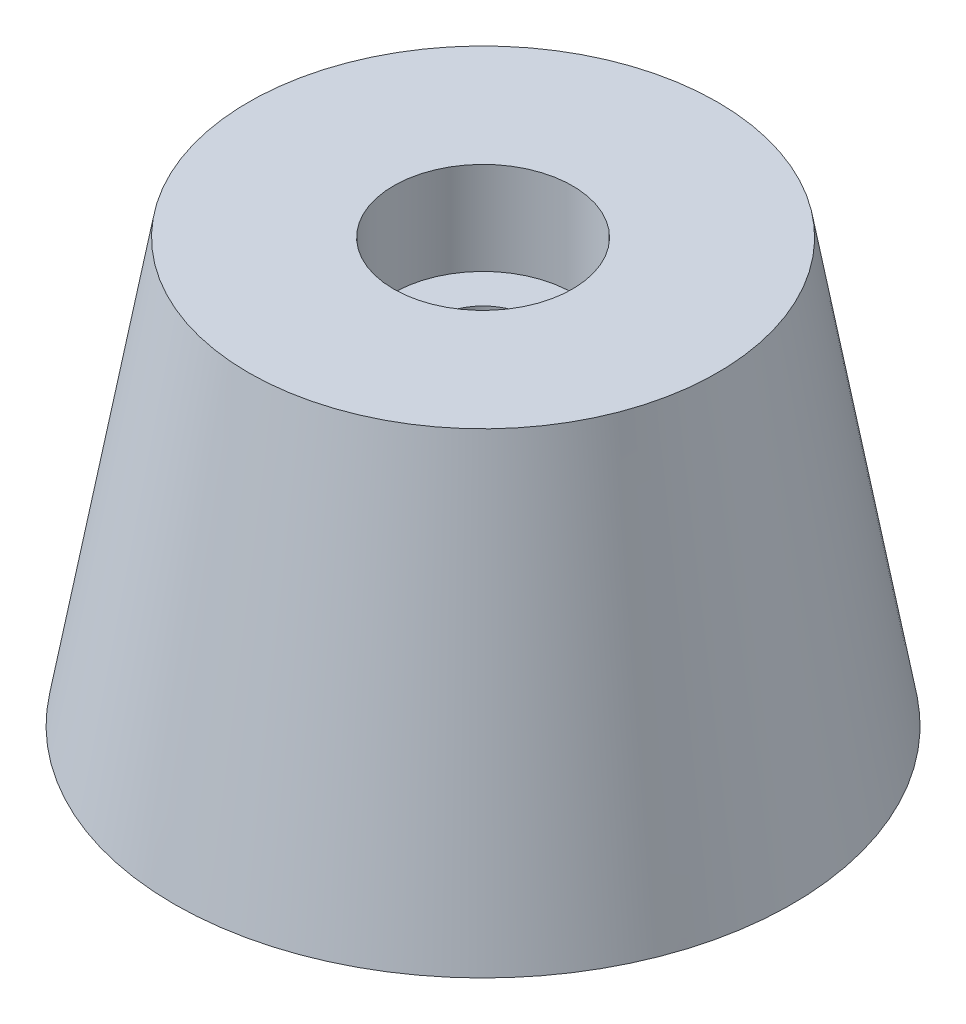
ISO-10303-21;
HEADER;
FILE_DESCRIPTION(('STEP AP214'),'2;1');
FILE_NAME('part.step','',(''),(''),'','','');
FILE_SCHEMA(('AUTOMOTIVE_DESIGN { 1 0 10303 214 1 1 1 1 }'));
ENDSEC;
DATA;
#1=APPLICATION_CONTEXT('core data for automotive mechanical design processes');
#2=APPLICATION_PROTOCOL_DEFINITION('international standard','automotive_design',2000,#1);
#3=PRODUCT_CONTEXT('',#1,'mechanical');
#4=PRODUCT('Part','Part','',(#3));
#5=PRODUCT_RELATED_PRODUCT_CATEGORY('part','',(#4));
#6=PRODUCT_DEFINITION_FORMATION('','',#4);
#7=PRODUCT_DEFINITION_CONTEXT('part definition',#1,'design');
#8=PRODUCT_DEFINITION('design','',#6,#7);
#9=PRODUCT_DEFINITION_SHAPE('','',#8);
#10=(LENGTH_UNIT() NAMED_UNIT(*) SI_UNIT(.MILLI.,.METRE.));
#11=(NAMED_UNIT(*) PLANE_ANGLE_UNIT() SI_UNIT($,.RADIAN.));
#12=(NAMED_UNIT(*) SI_UNIT($,.STERADIAN.) SOLID_ANGLE_UNIT());
#13=UNCERTAINTY_MEASURE_WITH_UNIT(LENGTH_MEASURE(1.E-05),#10,'distance_accuracy_value','');
#14=(GEOMETRIC_REPRESENTATION_CONTEXT(3) GLOBAL_UNCERTAINTY_ASSIGNED_CONTEXT((#13)) GLOBAL_UNIT_ASSIGNED_CONTEXT((#10,
#11,#12)) REPRESENTATION_CONTEXT('',''));
#15=CARTESIAN_POINT('',(0.,0.,0.));
#16=DIRECTION('',(0.,0.,1.));
#17=DIRECTION('',(1.,0.,0.));
#18=AXIS2_PLACEMENT_3D('',#15,#16,#17);
#19=CARTESIAN_POINT('',(0.,0.,0.));
#20=DIRECTION('',(0.,-1.,0.));
#21=DIRECTION('',(0.,0.,1.));
#22=AXIS2_PLACEMENT_3D('',#19,#20,#21);
#23=CONICAL_SURFACE('',#22,19.,0.174532925199433);
#24=CARTESIAN_POINT('',(0.,26.,0.));
#25=DIRECTION('',(0.,1.,0.));
#26=DIRECTION('',(0.,0.,1.));
#27=AXIS2_PLACEMENT_3D('',#24,#25,#26);
#28=CIRCLE('',#27,14.4154985015799);
#29=CARTESIAN_POINT('',(0.,26.,14.4154985015799));
#30=VERTEX_POINT('',#29);
#31=EDGE_CURVE('E10',#30,#30,#28,.T.);
#32=ORIENTED_EDGE('',*,*,#31,.F.);
#33=EDGE_LOOP('',(#32));
#34=FACE_BOUND('',#33,.T.);
#35=CARTESIAN_POINT('',(0.,0.,0.));
#36=DIRECTION('',(0.,1.,0.));
#37=DIRECTION('',(0.,0.,1.));
#38=AXIS2_PLACEMENT_3D('',#35,#36,#37);
#39=CIRCLE('',#38,19.);
#40=CARTESIAN_POINT('',(0.,0.,19.));
#41=VERTEX_POINT('',#40);
#42=EDGE_CURVE('E36',#41,#41,#39,.T.);
#43=ORIENTED_EDGE('',*,*,#42,.T.);
#44=EDGE_LOOP('',(#43));
#45=FACE_BOUND('',#44,.T.);
#46=ADVANCED_FACE('F30',(#34,#45),#23,.T.);
#47=CARTESIAN_POINT('',(0.,26.,0.));
#48=DIRECTION('',(0.,1.,0.));
#49=DIRECTION('',(0.,0.,1.));
#50=AXIS2_PLACEMENT_3D('',#47,#48,#49);
#51=PLANE('',#50);
#52=CARTESIAN_POINT('',(0.,26.,0.));
#53=DIRECTION('',(0.,1.,0.));
#54=DIRECTION('',(0.,0.,1.));
#55=AXIS2_PLACEMENT_3D('',#52,#53,#54);
#56=CIRCLE('',#55,5.49999999999999);
#57=CARTESIAN_POINT('',(0.,26.,5.49999999999999));
#58=VERTEX_POINT('',#57);
#59=EDGE_CURVE('E52',#58,#58,#56,.T.);
#60=ORIENTED_EDGE('',*,*,#59,.F.);
#61=EDGE_LOOP('',(#60));
#62=FACE_BOUND('',#61,.T.);
#63=ORIENTED_EDGE('',*,*,#31,.T.);
#64=EDGE_LOOP('',(#63));
#65=FACE_BOUND('',#64,.T.);
#66=ADVANCED_FACE('F58',(#62,#65),#51,.T.);
#67=CARTESIAN_POINT('',(0.,0.,0.));
#68=DIRECTION('',(0.,1.,0.));
#69=DIRECTION('',(0.,0.,1.));
#70=AXIS2_PLACEMENT_3D('',#67,#68,#69);
#71=PLANE('',#70);
#72=CARTESIAN_POINT('',(0.,0.,0.));
#73=DIRECTION('',(0.,1.,0.));
#74=DIRECTION('',(0.,0.,1.));
#75=AXIS2_PLACEMENT_3D('',#72,#73,#74);
#76=CIRCLE('',#75,2.89999999999999);
#77=CARTESIAN_POINT('',(0.,0.,2.89999999999999));
#78=VERTEX_POINT('',#77);
#79=EDGE_CURVE('E40',#78,#78,#76,.T.);
#80=ORIENTED_EDGE('',*,*,#79,.T.);
#81=EDGE_LOOP('',(#80));
#82=FACE_BOUND('',#81,.T.);
#83=ORIENTED_EDGE('',*,*,#42,.F.);
#84=EDGE_LOOP('',(#83));
#85=FACE_BOUND('',#84,.T.);
#86=ADVANCED_FACE('F60',(#82,#85),#71,.F.);
#87=CARTESIAN_POINT('',(0.,26.,0.));
#88=DIRECTION('',(0.,1.,0.));
#89=DIRECTION('',(0.,0.,1.));
#90=AXIS2_PLACEMENT_3D('',#87,#88,#89);
#91=CYLINDRICAL_SURFACE('',#90,2.9);
#92=ORIENTED_EDGE('',*,*,#79,.F.);
#93=EDGE_LOOP('',(#92));
#94=FACE_BOUND('',#93,.T.);
#95=CARTESIAN_POINT('',(0.,20.3,0.));
#96=DIRECTION('',(0.,1.,0.));
#97=DIRECTION('',(0.,0.,1.));
#98=AXIS2_PLACEMENT_3D('',#95,#96,#97);
#99=CIRCLE('',#98,2.9);
#100=CARTESIAN_POINT('',(0.,20.3,2.9));
#101=VERTEX_POINT('',#100);
#102=EDGE_CURVE('E44',#101,#101,#99,.T.);
#103=ORIENTED_EDGE('',*,*,#102,.T.);
#104=EDGE_LOOP('',(#103));
#105=FACE_BOUND('',#104,.T.);
#106=ADVANCED_FACE('F66',(#94,#105),#91,.F.);
#107=CARTESIAN_POINT('',(2.9,20.3,0.));
#108=DIRECTION('',(0.,-1.,0.));
#109=DIRECTION('',(0.,0.,-1.));
#110=AXIS2_PLACEMENT_3D('',#107,#108,#109);
#111=PLANE('',#110);
#112=ORIENTED_EDGE('',*,*,#102,.F.);
#113=EDGE_LOOP('',(#112));
#114=FACE_BOUND('',#113,.T.);
#115=CARTESIAN_POINT('',(0.,20.3,0.));
#116=DIRECTION('',(0.,1.,0.));
#117=DIRECTION('',(0.,0.,1.));
#118=AXIS2_PLACEMENT_3D('',#115,#116,#117);
#119=CIRCLE('',#118,5.5);
#120=CARTESIAN_POINT('',(0.,20.3,5.5));
#121=VERTEX_POINT('',#120);
#122=EDGE_CURVE('E49',#121,#121,#119,.T.);
#123=ORIENTED_EDGE('',*,*,#122,.T.);
#124=EDGE_LOOP('',(#123));
#125=FACE_BOUND('',#124,.T.);
#126=ADVANCED_FACE('F72',(#114,#125),#111,.F.);
#127=CARTESIAN_POINT('',(0.,26.,0.));
#128=DIRECTION('',(0.,1.,0.));
#129=DIRECTION('',(0.,0.,1.));
#130=AXIS2_PLACEMENT_3D('',#127,#128,#129);
#131=CYLINDRICAL_SURFACE('',#130,5.5);
#132=ORIENTED_EDGE('',*,*,#122,.F.);
#133=EDGE_LOOP('',(#132));
#134=FACE_BOUND('',#133,.T.);
#135=ORIENTED_EDGE('',*,*,#59,.T.);
#136=EDGE_LOOP('',(#135));
#137=FACE_BOUND('',#136,.T.);
#138=ADVANCED_FACE('F56',(#134,#137),#131,.F.);
#139=CLOSED_SHELL('',(#46,#66,#86,#106,#126,#138));
#140=MANIFOLD_SOLID_BREP('B2',#139);
#141=ADVANCED_BREP_SHAPE_REPRESENTATION('',(#18,#140),#14);
#142=SHAPE_DEFINITION_REPRESENTATION(#9,#141);
ENDSEC;
END-ISO-10303-21;
